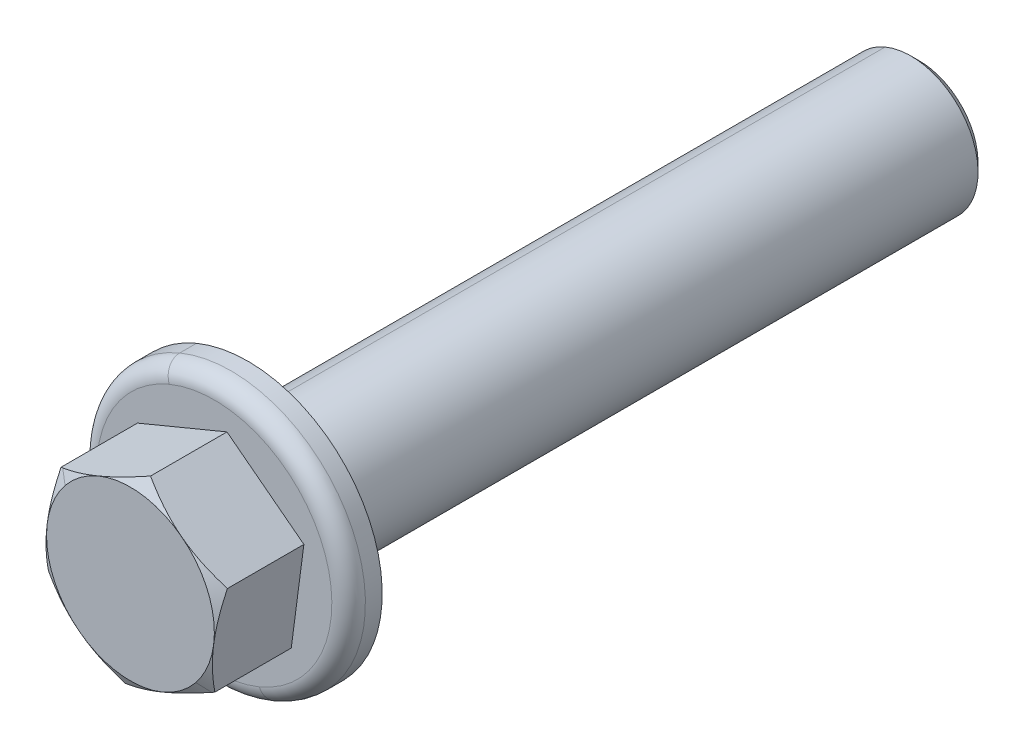
ISO-10303-21;
HEADER;
FILE_DESCRIPTION(('STEP AP214'),'2;1');
FILE_NAME('part.step','',(''),(''),'','','');
FILE_SCHEMA(('AUTOMOTIVE_DESIGN { 1 0 10303 214 1 1 1 1 }'));
ENDSEC;
DATA;
#1=APPLICATION_CONTEXT('core data for automotive mechanical design processes');
#2=APPLICATION_PROTOCOL_DEFINITION('international standard','automotive_design',2000,#1);
#3=PRODUCT_CONTEXT('',#1,'mechanical');
#4=PRODUCT('Part','Part','',(#3));
#5=PRODUCT_RELATED_PRODUCT_CATEGORY('part','',(#4));
#6=PRODUCT_DEFINITION_FORMATION('','',#4);
#7=PRODUCT_DEFINITION_CONTEXT('part definition',#1,'design');
#8=PRODUCT_DEFINITION('design','',#6,#7);
#9=PRODUCT_DEFINITION_SHAPE('','',#8);
#10=(LENGTH_UNIT() NAMED_UNIT(*) SI_UNIT(.MILLI.,.METRE.));
#11=(NAMED_UNIT(*) PLANE_ANGLE_UNIT() SI_UNIT($,.RADIAN.));
#12=(NAMED_UNIT(*) SI_UNIT($,.STERADIAN.) SOLID_ANGLE_UNIT());
#13=UNCERTAINTY_MEASURE_WITH_UNIT(LENGTH_MEASURE(1.E-05),#10,'distance_accuracy_value','');
#14=(GEOMETRIC_REPRESENTATION_CONTEXT(3) GLOBAL_UNCERTAINTY_ASSIGNED_CONTEXT((#13)) GLOBAL_UNIT_ASSIGNED_CONTEXT((#10,
#11,#12)) REPRESENTATION_CONTEXT('',''));
#15=CARTESIAN_POINT('',(0.,0.,0.));
#16=DIRECTION('',(0.,0.,1.));
#17=DIRECTION('',(1.,0.,0.));
#18=AXIS2_PLACEMENT_3D('',#15,#16,#17);
#19=CARTESIAN_POINT('',(125.,-43.,24.3));
#20=DIRECTION('',(0.,0.,1.));
#21=DIRECTION('',(0.923728021347068,0.383049008063238,0.));
#22=AXIS2_PLACEMENT_3D('',#19,#20,#21);
#23=TOROIDAL_SURFACE('',#22,4.25,0.25);
#24=CARTESIAN_POINT('',(125.,-43.,24.55));
#25=DIRECTION('',(0.,0.,-1.));
#26=DIRECTION('',(-0.923728021347068,-0.383049008063239,0.));
#27=AXIS2_PLACEMENT_3D('',#24,#25,#26);
#28=CIRCLE('',#27,4.25);
#29=CARTESIAN_POINT('',(126.627958284269,-46.925844090725,24.55));
#30=VERTEX_POINT('',#29);
#31=CARTESIAN_POINT('',(123.372041715731,-39.074155909275,24.55));
#32=VERTEX_POINT('',#31);
#33=EDGE_CURVE('E11',#30,#32,#28,.T.);
#34=ORIENTED_EDGE('',*,*,#33,.T.);
#35=CARTESIAN_POINT('',(123.372041715731,-39.074155909275,24.3));
#36=DIRECTION('',(0.923728021347068,0.383049008063238,0.));
#37=DIRECTION('',(0.,0.,1.));
#38=AXIS2_PLACEMENT_3D('',#35,#36,#37);
#39=CIRCLE('',#38,0.25);
#40=CARTESIAN_POINT('',(123.467803967747,-39.3050879146117,24.3));
#41=VERTEX_POINT('',#40);
#42=EDGE_CURVE('E33',#32,#41,#39,.T.);
#43=ORIENTED_EDGE('',*,*,#42,.T.);
#44=CARTESIAN_POINT('',(125.,-43.,24.3));
#45=DIRECTION('',(0.,0.,-1.));
#46=DIRECTION('',(-0.923728021347069,-0.383049008063237,0.));
#47=AXIS2_PLACEMENT_3D('',#44,#45,#46);
#48=CIRCLE('',#47,4.);
#49=CARTESIAN_POINT('',(126.532196032253,-46.6949120853883,24.3));
#50=VERTEX_POINT('',#49);
#51=EDGE_CURVE('E461',#50,#41,#48,.T.);
#52=ORIENTED_EDGE('',*,*,#51,.F.);
#53=CARTESIAN_POINT('',(126.627958284269,-46.925844090725,24.3));
#54=DIRECTION('',(-0.923728021347068,-0.383049008063238,0.));
#55=DIRECTION('',(0.,0.,1.));
#56=AXIS2_PLACEMENT_3D('',#53,#54,#55);
#57=CIRCLE('',#56,0.25);
#58=EDGE_CURVE('E457',#30,#50,#57,.T.);
#59=ORIENTED_EDGE('',*,*,#58,.F.);
#60=EDGE_LOOP('',(#34,#43,#52,#59));
#61=FACE_BOUND('',#60,.T.);
#62=ADVANCED_FACE('F17',(#61),#23,.F.);
#63=CARTESIAN_POINT('',(125.,-43.,24.3));
#64=DIRECTION('',(0.,0.,1.));
#65=DIRECTION('',(-0.383049008063241,0.923728021347067,0.));
#66=AXIS2_PLACEMENT_3D('',#63,#64,#65);
#67=TOROIDAL_SURFACE('',#66,4.25,0.25);
#68=CARTESIAN_POINT('',(125.,-43.,24.55));
#69=DIRECTION('',(0.,0.,-1.));
#70=DIRECTION('',(-0.923728021347068,-0.383049008063239,0.));
#71=AXIS2_PLACEMENT_3D('',#68,#69,#70);
#72=CIRCLE('',#71,4.25);
#73=EDGE_CURVE('E454',#32,#30,#72,.T.);
#74=ORIENTED_EDGE('',*,*,#73,.T.);
#75=ORIENTED_EDGE('',*,*,#58,.T.);
#76=CARTESIAN_POINT('',(125.,-43.,24.3));
#77=DIRECTION('',(0.,0.,-1.));
#78=DIRECTION('',(-0.923728021347069,-0.383049008063237,0.));
#79=AXIS2_PLACEMENT_3D('',#76,#77,#78);
#80=CIRCLE('',#79,4.);
#81=EDGE_CURVE('E465',#41,#50,#80,.T.);
#82=ORIENTED_EDGE('',*,*,#81,.F.);
#83=ORIENTED_EDGE('',*,*,#42,.F.);
#84=EDGE_LOOP('',(#74,#75,#82,#83));
#85=FACE_BOUND('',#84,.T.);
#86=ADVANCED_FACE('F311',(#85),#67,.F.);
#87=CARTESIAN_POINT('',(125.,-43.,4.55));
#88=DIRECTION('',(0.,0.,1.));
#89=DIRECTION('',(0.923728021347069,0.383049008063237,0.));
#90=AXIS2_PLACEMENT_3D('',#87,#88,#89);
#91=CYLINDRICAL_SURFACE('',#90,4.);
#92=DIRECTION('',(0.,0.,-1.));
#93=VECTOR('',#92,1.);
#94=CARTESIAN_POINT('',(126.532196032253,-46.6949120853883,4.55));
#95=LINE('',#94,#93);
#96=CARTESIAN_POINT('',(126.532196032253,-46.6949120853883,-14.95));
#97=VERTEX_POINT('',#96);
#98=EDGE_CURVE('E468',#50,#97,#95,.T.);
#99=ORIENTED_EDGE('',*,*,#98,.F.);
#100=ORIENTED_EDGE('',*,*,#51,.T.);
#101=DIRECTION('',(0.,0.,-1.));
#102=VECTOR('',#101,1.);
#103=CARTESIAN_POINT('',(123.467803967747,-39.3050879146117,4.55));
#104=LINE('',#103,#102);
#105=CARTESIAN_POINT('',(123.467803967747,-39.3050879146117,-14.95));
#106=VERTEX_POINT('',#105);
#107=EDGE_CURVE('E472',#41,#106,#104,.T.);
#108=ORIENTED_EDGE('',*,*,#107,.T.);
#109=CARTESIAN_POINT('',(125.,-43.,-14.95));
#110=DIRECTION('',(0.,0.,1.));
#111=DIRECTION('',(-0.923728021347069,-0.383049008063237,0.));
#112=AXIS2_PLACEMENT_3D('',#109,#110,#111);
#113=CIRCLE('',#112,4.);
#114=EDGE_CURVE('E467',#106,#97,#113,.T.);
#115=ORIENTED_EDGE('',*,*,#114,.T.);
#116=EDGE_LOOP('',(#99,#100,#108,#115));
#117=FACE_BOUND('',#116,.T.);
#118=ADVANCED_FACE('F317',(#117),#91,.T.);
#119=CARTESIAN_POINT('',(125.,-43.,4.55));
#120=DIRECTION('',(0.,0.,1.));
#121=DIRECTION('',(0.923728021347069,0.383049008063237,0.));
#122=AXIS2_PLACEMENT_3D('',#119,#120,#121);
#123=CYLINDRICAL_SURFACE('',#122,4.);
#124=ORIENTED_EDGE('',*,*,#107,.F.);
#125=ORIENTED_EDGE('',*,*,#81,.T.);
#126=ORIENTED_EDGE('',*,*,#98,.T.);
#127=CARTESIAN_POINT('',(125.,-43.,-14.95));
#128=DIRECTION('',(0.,0.,1.));
#129=DIRECTION('',(-0.923728021347069,-0.383049008063237,0.));
#130=AXIS2_PLACEMENT_3D('',#127,#128,#129);
#131=CIRCLE('',#130,4.);
#132=EDGE_CURVE('E471',#97,#106,#131,.T.);
#133=ORIENTED_EDGE('',*,*,#132,.T.);
#134=EDGE_LOOP('',(#124,#125,#126,#133));
#135=FACE_BOUND('',#134,.T.);
#136=ADVANCED_FACE('F322',(#135),#123,.T.);
#137=CARTESIAN_POINT('',(125.,-43.,-18.95));
#138=DIRECTION('',(0.,0.,1.));
#139=DIRECTION('',(-0.114958388351689,0.993370308066223,0.));
#140=AXIS2_PLACEMENT_3D('',#137,#138,#139);
#141=CONICAL_SURFACE('',#140,0.,0.785398163396999);
#142=DIRECTION('',(0.270856393052956,-0.653174413416782,-0.707106781186537));
#143=VECTOR('',#142,1.);
#144=CARTESIAN_POINT('',(123.563567058084,-39.5360195723158,-15.2));
#145=LINE('',#144,#143);
#146=CARTESIAN_POINT('',(123.659328713789,-39.7669518249291,-15.45));
#147=VERTEX_POINT('',#146);
#148=EDGE_CURVE('E478',#106,#147,#145,.T.);
#149=ORIENTED_EDGE('',*,*,#148,.T.);
#150=CARTESIAN_POINT('',(125.,-43.,-15.45));
#151=DIRECTION('',(0.,0.,1.));
#152=DIRECTION('',(0.993370308066188,0.114958388351986,0.));
#153=AXIS2_PLACEMENT_3D('',#150,#151,#152);
#154=CIRCLE('',#153,3.5);
#155=CARTESIAN_POINT('',(126.340671528221,-46.2330480747147,-15.45));
#156=VERTEX_POINT('',#155);
#157=EDGE_CURVE('E481',#147,#156,#154,.T.);
#158=ORIENTED_EDGE('',*,*,#157,.T.);
#159=DIRECTION('',(-0.270856551128283,0.65317434786655,-0.707106781186547));
#160=VECTOR('',#159,1.);
#161=CARTESIAN_POINT('',(126.436433780237,-46.4639800800515,-15.2));
#162=LINE('',#161,#160);
#163=EDGE_CURVE('E484',#97,#156,#162,.T.);
#164=ORIENTED_EDGE('',*,*,#163,.F.);
#165=ORIENTED_EDGE('',*,*,#114,.F.);
#166=EDGE_LOOP('',(#149,#158,#164,#165));
#167=FACE_BOUND('',#166,.T.);
#168=ADVANCED_FACE('F326',(#167),#141,.T.);
#169=CARTESIAN_POINT('',(125.,-42.9999999999988,-18.95));
#170=DIRECTION('',(-2.07112037355488E-13,-2.99341000002082E-13,1.));
#171=DIRECTION('',(0.383049008063238,-0.923728021347068,-1.97175609173E-13));
#172=AXIS2_PLACEMENT_3D('',#169,#170,#171);
#173=CONICAL_SURFACE('',#172,0.,0.785398163396999);
#174=ORIENTED_EDGE('',*,*,#163,.T.);
#175=CARTESIAN_POINT('',(125.,-43.,-15.4499999999993));
#176=DIRECTION('',(-2.8263995886347E-13,-1.17204364682804E-13,1.));
#177=DIRECTION('',(0.923728021347068,0.383049008063238,3.05977465587E-13));
#178=AXIS2_PLACEMENT_3D('',#175,#176,#177);
#179=CIRCLE('',#178,3.5);
#180=EDGE_CURVE('E352',#156,#147,#179,.T.);
#181=ORIENTED_EDGE('',*,*,#180,.T.);
#182=ORIENTED_EDGE('',*,*,#148,.F.);
#183=ORIENTED_EDGE('',*,*,#132,.F.);
#184=EDGE_LOOP('',(#174,#181,#182,#183));
#185=FACE_BOUND('',#184,.T.);
#186=ADVANCED_FACE('F330',(#185),#173,.T.);
#187=CARTESIAN_POINT('',(125.,-43.,-15.45));
#188=DIRECTION('',(0.,0.,1.));
#189=DIRECTION('',(-0.383049008063238,0.923728021347068,0.));
#190=AXIS2_PLACEMENT_3D('',#187,#188,#189);
#191=PLANE('',#190);
#192=ORIENTED_EDGE('',*,*,#180,.F.);
#193=ORIENTED_EDGE('',*,*,#157,.F.);
#194=EDGE_LOOP('',(#192,#193));
#195=FACE_BOUND('',#194,.T.);
#196=ADVANCED_FACE('F334',(#195),#191,.F.);
#197=CARTESIAN_POINT('',(125.,-43.,31.55));
#198=DIRECTION('',(0.,0.,1.));
#199=DIRECTION('',(0.923728021347068,0.383049008063238,0.));
#200=AXIS2_PLACEMENT_3D('',#197,#198,#199);
#201=PLANE('',#200);
#202=CARTESIAN_POINT('',(125.,-43.,31.55));
#203=DIRECTION('',(0.,0.,1.));
#204=DIRECTION('',(-0.923728021347068,-0.383049008063239,0.));
#205=AXIS2_PLACEMENT_3D('',#202,#203,#204);
#206=CIRCLE('',#205,5.);
#207=CARTESIAN_POINT('',(129.95748218353,-43.6506691939829,31.5499999999993));
#208=VERTEX_POINT('',#207);
#209=CARTESIAN_POINT('',(128.042237143212,-39.0320290872445,31.5499999999992));
#210=VERTEX_POINT('',#209);
#211=EDGE_CURVE('E347',#208,#210,#206,.T.);
#212=ORIENTED_EDGE('',*,*,#211,.T.);
#213=CARTESIAN_POINT('',(125.,-43.,31.55));
#214=DIRECTION('',(0.,0.,1.));
#215=DIRECTION('',(-0.923728021347068,-0.383049008063239,0.));
#216=AXIS2_PLACEMENT_3D('',#213,#214,#215);
#217=CIRCLE('',#216,5.);
#218=CARTESIAN_POINT('',(123.084754959684,-38.3813598932646,31.55));
#219=VERTEX_POINT('',#218);
#220=EDGE_CURVE('E353',#210,#219,#217,.T.);
#221=ORIENTED_EDGE('',*,*,#220,.T.);
#222=CARTESIAN_POINT('',(125.,-43.,31.55));
#223=DIRECTION('',(0.,0.,1.));
#224=DIRECTION('',(-0.923728021347068,-0.383049008063239,0.));
#225=AXIS2_PLACEMENT_3D('',#222,#223,#224);
#226=CIRCLE('',#225,5.);
#227=CARTESIAN_POINT('',(121.104920330083,-39.8649793676955,31.55));
#228=VERTEX_POINT('',#227);
#229=EDGE_CURVE('E368',#219,#228,#226,.T.);
#230=ORIENTED_EDGE('',*,*,#229,.T.);
#231=CARTESIAN_POINT('',(125.,-43.,31.55));
#232=DIRECTION('',(0.,0.,1.));
#233=DIRECTION('',(-0.923728021347068,-0.383049008063239,0.));
#234=AXIS2_PLACEMENT_3D('',#231,#232,#233);
#235=CIRCLE('',#234,5.);
#236=CARTESIAN_POINT('',(120.04251781647,-42.3493308060172,31.5499999999993));
#237=VERTEX_POINT('',#236);
#238=EDGE_CURVE('E372',#228,#237,#235,.T.);
#239=ORIENTED_EDGE('',*,*,#238,.T.);
#240=CARTESIAN_POINT('',(125.,-43.,31.55));
#241=DIRECTION('',(0.,0.,1.));
#242=DIRECTION('',(-0.923728021347068,-0.383049008063239,0.));
#243=AXIS2_PLACEMENT_3D('',#240,#241,#242);
#244=CIRCLE('',#243,5.);
#245=CARTESIAN_POINT('',(121.957762856788,-46.9679709127555,31.5499999999992));
#246=VERTEX_POINT('',#245);
#247=EDGE_CURVE('E172',#237,#246,#244,.T.);
#248=ORIENTED_EDGE('',*,*,#247,.T.);
#249=CARTESIAN_POINT('',(125.,-43.,31.55));
#250=DIRECTION('',(0.,0.,1.));
#251=DIRECTION('',(-0.923728021347068,-0.383049008063239,0.));
#252=AXIS2_PLACEMENT_3D('',#249,#250,#251);
#253=CIRCLE('',#252,5.);
#254=CARTESIAN_POINT('',(126.915245040316,-47.6186401067354,31.55));
#255=VERTEX_POINT('',#254);
#256=EDGE_CURVE('E147',#246,#255,#253,.T.);
#257=ORIENTED_EDGE('',*,*,#256,.T.);
#258=CARTESIAN_POINT('',(125.,-43.,31.55));
#259=DIRECTION('',(0.,0.,1.));
#260=DIRECTION('',(-0.923728021347068,-0.383049008063239,0.));
#261=AXIS2_PLACEMENT_3D('',#258,#259,#260);
#262=CIRCLE('',#261,5.);
#263=CARTESIAN_POINT('',(128.895079669917,-46.1350206323045,31.55));
#264=VERTEX_POINT('',#263);
#265=EDGE_CURVE('E160',#255,#264,#262,.T.);
#266=ORIENTED_EDGE('',*,*,#265,.T.);
#267=CARTESIAN_POINT('',(125.,-43.,31.55));
#268=DIRECTION('',(0.,0.,1.));
#269=DIRECTION('',(-0.923728021347068,-0.383049008063239,0.));
#270=AXIS2_PLACEMENT_3D('',#267,#268,#269);
#271=CIRCLE('',#270,5.);
#272=EDGE_CURVE('E166',#264,#208,#271,.T.);
#273=ORIENTED_EDGE('',*,*,#272,.T.);
#274=EDGE_LOOP('',(#212,#221,#230,#239,#248,#257,#266,#273));
#275=FACE_BOUND('',#274,.T.);
#276=ADVANCED_FACE('F169',(#275),#201,.T.);
#277=CARTESIAN_POINT('',(125.,-43.,31.55));
#278=DIRECTION('',(0.,0.,-1.));
#279=DIRECTION('',(0.779015933983816,-0.62700412646116,0.));
#280=AXIS2_PLACEMENT_3D('',#277,#278,#279);
#281=CONICAL_SURFACE('',#280,5.,1.0471975512);
#282=ORIENTED_EDGE('',*,*,#211,.F.);
#283=CARTESIAN_POINT('',(130.333146217831,-40.788465520816,31.1034180126157));
#284=CARTESIAN_POINT('',(130.3025673255,-41.0214476802984,31.1712680083951));
#285=CARTESIAN_POINT('',(130.271743546411,-41.2562956446373,31.2334304503107));
#286=CARTESIAN_POINT('',(130.209824279666,-41.7280617349024,31.3430527974047));
#287=CARTESIAN_POINT('',(130.178730951812,-41.9649634052019,31.3905854034297));
#288=CARTESIAN_POINT('',(130.131797514476,-42.322551687472,31.4489473736346));
#289=CARTESIAN_POINT('',(130.11609374839,-42.442199492084,31.4662522919641));
#290=CARTESIAN_POINT('',(130.084611035887,-42.6820679041194,31.4962074663214));
#291=CARTESIAN_POINT('',(130.068832091461,-42.8022884963822,31.5088578448603));
#292=CARTESIAN_POINT('',(130.037140657916,-43.0437471648116,31.5292816727013));
#293=CARTESIAN_POINT('',(130.021227896041,-43.1649873191297,31.5370303207408));
#294=CARTESIAN_POINT('',(129.989371077041,-43.4077060678825,31.5474002095296));
#295=CARTESIAN_POINT('',(129.973427014344,-43.5291847047729,31.5500204348121));
#296=CARTESIAN_POINT('',(129.957482183531,-43.650669193983,31.5499999999984));
#297=B_SPLINE_CURVE_WITH_KNOTS('',3,(#283,#284,#285,#286,#287,#288,#289,#290,#291,#292,#293,
#294,#295,#296),.UNSPECIFIED.,.F.,.F.,(4,2,2,2,2,2,4),(0.,0.734036658391584,1.46436443241697,
1.83000749078367,2.19564092445857,2.56310985866722,2.93065154716803),.UNSPECIFIED.);
#298=CARTESIAN_POINT('',(130.333146217831,-40.788465520817,31.1034180126157));
#299=VERTEX_POINT('',#298);
#300=EDGE_CURVE('E218',#299,#208,#297,.T.);
#301=ORIENTED_EDGE('',*,*,#300,.F.);
#302=CARTESIAN_POINT('',(128.042237143213,-39.0320290872434,31.5499999999984));
#303=CARTESIAN_POINT('',(128.139473381628,-39.1065799603917,31.5500204348121));
#304=CARTESIAN_POINT('',(128.236704935844,-39.1811272421717,31.5474002095296));
#305=CARTESIAN_POINT('',(128.430977128739,-39.3300754310856,31.5370303207408));
#306=CARTESIAN_POINT('',(128.5280178014,-39.4044763642732,31.5292816727013));
#307=CARTESIAN_POINT('',(128.721281425451,-39.5526512850197,31.5088578448603));
#308=CARTESIAN_POINT('',(128.817506040196,-39.626426547869,31.4962074663214));
#309=CARTESIAN_POINT('',(129.009496822333,-39.773625582694,31.4662522919641));
#310=CARTESIAN_POINT('',(129.10526297759,-39.8470493453661,31.4489473736346));
#311=CARTESIAN_POINT('',(129.391476795464,-40.0664890355205,31.3905854034297));
#312=CARTESIAN_POINT('',(129.581092996215,-40.2118674824807,31.3430527974047));
#313=CARTESIAN_POINT('',(129.958694781657,-40.5013741855972,31.2334304503107));
#314=CARTESIAN_POINT('',(130.146667195257,-40.6454923434987,31.1712680083951));
#315=CARTESIAN_POINT('',(130.333146217832,-40.7884655208181,31.1034180126157));
#316=B_SPLINE_CURVE_WITH_KNOTS('',3,(#302,#303,#304,#305,#306,#307,#308,#309,#310,#311,#312,
#313,#314,#315),.UNSPECIFIED.,.F.,.F.,(4,2,2,2,2,2,4),(0.,0.367541688500858,0.735010622709565,
1.10064405638451,1.46628711475129,2.19661488877679,2.93065154716846),.UNSPECIFIED.);
#317=EDGE_CURVE('E234',#210,#299,#316,.T.);
#318=ORIENTED_EDGE('',*,*,#317,.F.);
#319=EDGE_LOOP('',(#282,#301,#318));
#320=FACE_BOUND('',#319,.T.);
#321=ADVANCED_FACE('F248',(#320),#281,.T.);
#322=CARTESIAN_POINT('',(125.,-43.,31.55));
#323=DIRECTION('',(0.,0.,-1.));
#324=DIRECTION('',(0.779015933983816,-0.62700412646116,0.));
#325=AXIS2_PLACEMENT_3D('',#322,#323,#324);
#326=CONICAL_SURFACE('',#325,5.,1.0471975512);
#327=ORIENTED_EDGE('',*,*,#220,.F.);
#328=CARTESIAN_POINT('',(125.751328068599,-37.2755926536722,31.1034180126172));
#329=CARTESIAN_POINT('',(125.937807091173,-37.4185658309914,31.1712680083964));
#330=CARTESIAN_POINT('',(126.125779504773,-37.5626839888926,31.2334304503118));
#331=CARTESIAN_POINT('',(126.503381290214,-37.8521906920085,31.3430527974054));
#332=CARTESIAN_POINT('',(126.692997490964,-37.9975691389684,31.3905854034303));
#333=CARTESIAN_POINT('',(126.979211308838,-38.2170088291224,31.448947373635));
#334=CARTESIAN_POINT('',(127.074977464095,-38.2904325917943,31.4662522919644));
#335=CARTESIAN_POINT('',(127.266968246232,-38.437631626619,31.4962074663216));
#336=CARTESIAN_POINT('',(127.363192860976,-38.5114068894682,31.5088578448604));
#337=CARTESIAN_POINT('',(127.556456485027,-38.6595818102144,31.5292816727014));
#338=CARTESIAN_POINT('',(127.653497157688,-38.7339827434018,31.5370303207409));
#339=CARTESIAN_POINT('',(127.847769350582,-38.8829309323154,31.5474002095296));
#340=CARTESIAN_POINT('',(127.945000904798,-38.9574782140952,31.5500204348121));
#341=CARTESIAN_POINT('',(128.042237143213,-39.0320290872434,31.5499999999984));
#342=B_SPLINE_CURVE_WITH_KNOTS('',3,(#328,#329,#330,#331,#332,#333,#334,#335,#336,#337,#338,
#339,#340,#341),.UNSPECIFIED.,.F.,.F.,(4,2,2,2,2,2,4),(0.,0.734036658390181,1.46436443241422,
1.83000749078024,2.19564092445444,2.56310985866231,2.93065154716246),.UNSPECIFIED.);
#343=CARTESIAN_POINT('',(125.7513280686,-37.2755926536723,31.1034180126172));
#344=VERTEX_POINT('',#343);
#345=EDGE_CURVE('E225',#344,#210,#342,.T.);
#346=ORIENTED_EDGE('',*,*,#345,.F.);
#347=CARTESIAN_POINT('',(123.084754959684,-38.3813598932646,31.55));
#348=CARTESIAN_POINT('',(123.197936028912,-38.3344262772027,31.5500204348137));
#349=CARTESIAN_POINT('',(123.311111645825,-38.2874949220923,31.5474002095312));
#350=CARTESIAN_POINT('',(123.537240657719,-38.1937243622535,31.5370303207423));
#351=CARTESIAN_POINT('',(123.650194092255,-38.146885141123,31.5292816727028));
#352=CARTESIAN_POINT('',(123.875149149851,-38.0536013934401,31.5088578448618));
#353=CARTESIAN_POINT('',(123.987152709022,-38.0071560640266,31.4962074663229));
#354=CARTESIAN_POINT('',(124.210626203661,-37.9144866868162,31.4662522919656));
#355=CARTESIAN_POINT('',(124.322096125006,-37.8682626448763,31.4489473736361));
#356=CARTESIAN_POINT('',(124.655243380215,-37.7301140527607,31.3905854034312));
#357=CARTESIAN_POINT('',(124.87595290882,-37.6385908294214,31.3430527974062));
#358=CARTESIAN_POINT('',(125.315473961006,-37.4563314422729,31.2334304503122));
#359=CARTESIAN_POINT('',(125.534270153695,-37.3656016358355,31.1712680083966));
#360=CARTESIAN_POINT('',(125.751328068601,-37.2755926536725,31.1034180126172));
#361=B_SPLINE_CURVE_WITH_KNOTS('',3,(#347,#348,#349,#350,#351,#352,#353,#354,#355,#356,#357,
#358,#359,#360),.UNSPECIFIED.,.F.,.F.,(4,2,2,2,2,2,4),(0.,0.367541688500744,0.735010622709319,
1.10064405638414,1.46628711475078,2.19661488877598,2.93065154716748),.UNSPECIFIED.);
#362=EDGE_CURVE('E256',#219,#344,#361,.T.);
#363=ORIENTED_EDGE('',*,*,#362,.F.);
#364=EDGE_LOOP('',(#327,#346,#363));
#365=FACE_BOUND('',#364,.T.);
#366=ADVANCED_FACE('F243',(#365),#326,.T.);
#367=CARTESIAN_POINT('',(125.,-43.,31.55));
#368=DIRECTION('',(0.,0.,-1.));
#369=DIRECTION('',(0.779015933983816,-0.62700412646116,0.));
#370=AXIS2_PLACEMENT_3D('',#367,#368,#369);
#371=CONICAL_SURFACE('',#370,5.,1.0471975512);
#372=DIRECTION('',(0.674647588782705,-0.543001501793055,0.500000000000169));
#373=VECTOR('',#372,1.);
#374=CARTESIAN_POINT('',(119.366922415415,-38.4661224037524,30.2619216436));
#375=LINE('',#374,#373);
#376=CARTESIAN_POINT('',(120.561580369679,-39.4276630274513,31.147315717563));
#377=VERTEX_POINT('',#376);
#378=EDGE_CURVE('E359',#377,#228,#375,.T.);
#379=ORIENTED_EDGE('',*,*,#378,.T.);
#380=ORIENTED_EDGE('',*,*,#229,.F.);
#381=CARTESIAN_POINT('',(120.561580369675,-39.4276630274456,31.1473157175507));
#382=CARTESIAN_POINT('',(120.767321714802,-39.342346769475,31.2089939702821));
#383=CARTESIAN_POINT('',(120.974622429953,-39.2563838762071,31.2652901400361));
#384=CARTESIAN_POINT('',(121.390932907383,-39.0837493866827,31.3643275190329));
#385=CARTESIAN_POINT('',(121.599930196708,-38.9970829626767,31.4071306974177));
#386=CARTESIAN_POINT('',(121.915212095264,-38.8663427277683,31.45956230126));
#387=CARTESIAN_POINT('',(122.02066262896,-38.8226147890261,31.475082637656));
#388=CARTESIAN_POINT('',(122.232020427228,-38.7349695156316,31.5019229351795));
#389=CARTESIAN_POINT('',(122.337927683107,-38.6910521845844,31.5132429759078));
#390=CARTESIAN_POINT('',(122.550560143613,-38.6028783377413,31.5315033490443));
#391=CARTESIAN_POINT('',(122.657286864002,-38.5586211933935,31.5384231328081));
#392=CARTESIAN_POINT('',(122.870925975233,-38.4700299113827,31.5476799879821));
#393=CARTESIAN_POINT('',(122.977838392784,-38.425695762644,31.5500163340106));
#394=CARTESIAN_POINT('',(123.084754959684,-38.3813598932646,31.55));
#395=B_SPLINE_CURVE_WITH_KNOTS('',3,(#381,#382,#383,#384,#385,#386,#387,#388,#389,#390,#391,
#392,#393,#394),.UNSPECIFIED.,.F.,.F.,(4,2,2,2,2,2,4),(0.,0.693572709725148,1.38391201165264,
1.72946469135599,2.07501082206967,2.42215898329328,2.76936208027106),.UNSPECIFIED.);
#396=EDGE_CURVE('E262',#377,#219,#395,.T.);
#397=ORIENTED_EDGE('',*,*,#396,.F.);
#398=EDGE_LOOP('',(#379,#380,#397));
#399=FACE_BOUND('',#398,.T.);
#400=ADVANCED_FACE('F247',(#399),#371,.T.);
#401=CARTESIAN_POINT('',(125.,-43.,31.55));
#402=DIRECTION('',(0.,0.,-1.));
#403=DIRECTION('',(0.779015933983816,-0.62700412646116,0.));
#404=AXIS2_PLACEMENT_3D('',#401,#402,#403);
#405=CONICAL_SURFACE('',#404,5.,1.0471975512);
#406=ORIENTED_EDGE('',*,*,#238,.F.);
#407=ORIENTED_EDGE('',*,*,#378,.F.);
#408=CARTESIAN_POINT('',(120.561580369681,-39.4276630274507,31.1473157175));
#409=CARTESIAN_POINT('',(120.514400627322,-39.4472273939026,31.1331782382));
#410=CARTESIAN_POINT('',(120.466617991441,-39.4670417665899,31.1185548376));
#411=CARTESIAN_POINT('',(120.418181850768,-39.487127132856,31.1034180126));
#412=B_SPLINE_CURVE_WITH_KNOTS('',3,(#408,#409,#410,#411),.UNSPECIFIED.,.F.,.F.,(4,4),(0.,1.),.UNSPECIFIED.);
#413=CARTESIAN_POINT('',(120.418181850768,-39.4871271328537,31.1034180126081));
#414=VERTEX_POINT('',#413);
#415=EDGE_CURVE('E362',#377,#414,#412,.T.);
#416=ORIENTED_EDGE('',*,*,#415,.T.);
#417=CARTESIAN_POINT('',(120.042517816469,-42.349330806017,31.5499999999984));
#418=CARTESIAN_POINT('',(120.058462647282,-42.2278463168069,31.5500204348121));
#419=CARTESIAN_POINT('',(120.074406709979,-42.1063676799165,31.5474002095296));
#420=CARTESIAN_POINT('',(120.106263528978,-41.8636489311638,31.5370303207409));
#421=CARTESIAN_POINT('',(120.122176290854,-41.7424087768458,31.5292816727013));
#422=CARTESIAN_POINT('',(120.153867724398,-41.5009501084165,31.5088578448604));
#423=CARTESIAN_POINT('',(120.169646668825,-41.3807295161538,31.4962074663215));
#424=CARTESIAN_POINT('',(120.201129381327,-41.1408611041186,31.4662522919642));
#425=CARTESIAN_POINT('',(120.216833147414,-41.0212132995066,31.4489473736348));
#426=CARTESIAN_POINT('',(120.263766584749,-40.6636250172367,31.3905854034299));
#427=CARTESIAN_POINT('',(120.294859912604,-40.4267233469373,31.343052797405));
#428=CARTESIAN_POINT('',(120.356779179348,-39.9549572566725,31.2334304503111));
#429=CARTESIAN_POINT('',(120.387602958438,-39.7201092923337,31.1712680083955));
#430=CARTESIAN_POINT('',(120.418181850769,-39.4871271328513,31.1034180126162));
#431=B_SPLINE_CURVE_WITH_KNOTS('',3,(#417,#418,#419,#420,#421,#422,#423,#424,#425,#426,#427,
#428,#429,#430),.UNSPECIFIED.,.F.,.F.,(4,2,2,2,2,2,4),(0.,0.367541688500619,0.73501062270906,
1.10064405638376,1.46628711475026,2.19661488877526,2.93065154716644),.UNSPECIFIED.);
#432=EDGE_CURVE('E287',#237,#414,#431,.T.);
#433=ORIENTED_EDGE('',*,*,#432,.F.);
#434=EDGE_LOOP('',(#406,#407,#416,#433));
#435=FACE_BOUND('',#434,.T.);
#436=ADVANCED_FACE('F297',(#435),#405,.T.);
#437=CARTESIAN_POINT('',(125.,-43.,31.55));
#438=DIRECTION('',(0.,0.,-1.));
#439=DIRECTION('',(0.779015933983816,-0.62700412646116,0.));
#440=AXIS2_PLACEMENT_3D('',#437,#438,#439);
#441=CONICAL_SURFACE('',#440,5.,1.0471975512);
#442=ORIENTED_EDGE('',*,*,#247,.F.);
#443=CARTESIAN_POINT('',(119.666853782169,-45.2115344791841,31.1034180126157));
#444=CARTESIAN_POINT('',(119.6974326745,-44.9785523197016,31.1712680083951));
#445=CARTESIAN_POINT('',(119.728256453589,-44.7437043553627,31.2334304503107));
#446=CARTESIAN_POINT('',(119.790175720334,-44.2719382650976,31.3430527974047));
#447=CARTESIAN_POINT('',(119.821269048188,-44.0350365947981,31.3905854034297));
#448=CARTESIAN_POINT('',(119.868202485524,-43.677448312528,31.4489473736346));
#449=CARTESIAN_POINT('',(119.88390625161,-43.557800507916,31.4662522919641));
#450=CARTESIAN_POINT('',(119.915388964113,-43.3179320958806,31.4962074663214));
#451=CARTESIAN_POINT('',(119.931167908539,-43.1977115036178,31.5088578448603));
#452=CARTESIAN_POINT('',(119.962859342084,-42.9562528351884,31.5292816727013));
#453=CARTESIAN_POINT('',(119.978772103959,-42.8350126808703,31.5370303207408));
#454=CARTESIAN_POINT('',(120.010628922959,-42.5922939321175,31.5474002095296));
#455=CARTESIAN_POINT('',(120.026572985656,-42.4708152952271,31.5500204348121));
#456=CARTESIAN_POINT('',(120.042517816469,-42.349330806017,31.5499999999984));
#457=B_SPLINE_CURVE_WITH_KNOTS('',3,(#443,#444,#445,#446,#447,#448,#449,#450,#451,#452,#453,
#454,#455,#456),.UNSPECIFIED.,.F.,.F.,(4,2,2,2,2,2,4),(0.,0.734036658391593,1.464364432417,
1.83000749078371,2.19564092445861,2.56310985866726,2.93065154716809),.UNSPECIFIED.);
#458=CARTESIAN_POINT('',(119.666853782168,-45.211534479183,31.1034180126157));
#459=VERTEX_POINT('',#458);
#460=EDGE_CURVE('E268',#459,#237,#457,.T.);
#461=ORIENTED_EDGE('',*,*,#460,.F.);
#462=CARTESIAN_POINT('',(121.957762856787,-46.9679709127566,31.5499999999984));
#463=CARTESIAN_POINT('',(121.860526618372,-46.8934200396083,31.5500204348121));
#464=CARTESIAN_POINT('',(121.763295064156,-46.8188727578283,31.5474002095296));
#465=CARTESIAN_POINT('',(121.569022871261,-46.6699245689144,31.5370303207408));
#466=CARTESIAN_POINT('',(121.4719821986,-46.5955236357268,31.5292816727013));
#467=CARTESIAN_POINT('',(121.278718574549,-46.4473487149803,31.5088578448603));
#468=CARTESIAN_POINT('',(121.182493959804,-46.373573452131,31.4962074663214));
#469=CARTESIAN_POINT('',(120.990503177667,-46.226374417306,31.4662522919641));
#470=CARTESIAN_POINT('',(120.89473702241,-46.1529506546339,31.4489473736346));
#471=CARTESIAN_POINT('',(120.608523204536,-45.9335109644795,31.3905854034297));
#472=CARTESIAN_POINT('',(120.418907003785,-45.7881325175194,31.3430527974047));
#473=CARTESIAN_POINT('',(120.041305218343,-45.4986258144028,31.2334304503107));
#474=CARTESIAN_POINT('',(119.853332804743,-45.3545076565014,31.1712680083951));
#475=CARTESIAN_POINT('',(119.666853782168,-45.211534479182,31.1034180126157));
#476=B_SPLINE_CURVE_WITH_KNOTS('',3,(#462,#463,#464,#465,#466,#467,#468,#469,#470,#471,#472,
#473,#474,#475),.UNSPECIFIED.,.F.,.F.,(4,2,2,2,2,2,4),(0.,0.367541688500851,0.735010622709547,
1.10064405638448,1.46628711475124,2.19661488877673,2.93065154716842),.UNSPECIFIED.);
#477=EDGE_CURVE('E188',#246,#459,#476,.T.);
#478=ORIENTED_EDGE('',*,*,#477,.F.);
#479=EDGE_LOOP('',(#442,#461,#478));
#480=FACE_BOUND('',#479,.T.);
#481=ADVANCED_FACE('F300',(#480),#441,.T.);
#482=CARTESIAN_POINT('',(125.,-43.,31.55));
#483=DIRECTION('',(0.,0.,-1.));
#484=DIRECTION('',(0.779015933983816,-0.62700412646116,0.));
#485=AXIS2_PLACEMENT_3D('',#482,#483,#484);
#486=CONICAL_SURFACE('',#485,5.,1.0471975512);
#487=ORIENTED_EDGE('',*,*,#256,.F.);
#488=CARTESIAN_POINT('',(124.248671931401,-48.7244073463278,31.1034180126172));
#489=CARTESIAN_POINT('',(124.062192908827,-48.5814341690087,31.1712680083964));
#490=CARTESIAN_POINT('',(123.874220495227,-48.4373160111075,31.2334304503118));
#491=CARTESIAN_POINT('',(123.496618709786,-48.1478093079915,31.3430527974054));
#492=CARTESIAN_POINT('',(123.307002509036,-48.0024308610316,31.3905854034303));
#493=CARTESIAN_POINT('',(123.020788691162,-47.7829911708776,31.448947373635));
#494=CARTESIAN_POINT('',(122.925022535905,-47.7095674082057,31.4662522919644));
#495=CARTESIAN_POINT('',(122.733031753768,-47.562368373381,31.4962074663216));
#496=CARTESIAN_POINT('',(122.636807139024,-47.4885931105318,31.5088578448604));
#497=CARTESIAN_POINT('',(122.443543514973,-47.3404181897857,31.5292816727013));
#498=CARTESIAN_POINT('',(122.346502842312,-47.2660172565982,31.5370303207408));
#499=CARTESIAN_POINT('',(122.152230649418,-47.1170690676846,31.5474002095296));
#500=CARTESIAN_POINT('',(122.054999095202,-47.0425217859048,31.5500204348121));
#501=CARTESIAN_POINT('',(121.957762856787,-46.9679709127566,31.5499999999984));
#502=B_SPLINE_CURVE_WITH_KNOTS('',3,(#488,#489,#490,#491,#492,#493,#494,#495,#496,#497,#498,
#499,#500,#501),.UNSPECIFIED.,.F.,.F.,(4,2,2,2,2,2,4),(0.,0.734036658390168,1.46436443241419,
1.83000749078021,2.19564092445441,2.56310985866236,2.93065154716247),.UNSPECIFIED.);
#503=CARTESIAN_POINT('',(124.2486719314,-48.7244073463276,31.1034180126172));
#504=VERTEX_POINT('',#503);
#505=EDGE_CURVE('E150',#504,#246,#502,.T.);
#506=ORIENTED_EDGE('',*,*,#505,.F.);
#507=CARTESIAN_POINT('',(126.915245040316,-47.6186401067355,31.55));
#508=CARTESIAN_POINT('',(126.802063971088,-47.6655737227973,31.5500204348137));
#509=CARTESIAN_POINT('',(126.688888354175,-47.7125050779077,31.5474002095312));
#510=CARTESIAN_POINT('',(126.462759342281,-47.8062756377465,31.5370303207423));
#511=CARTESIAN_POINT('',(126.349805907745,-47.853114858877,31.5292816727028));
#512=CARTESIAN_POINT('',(126.124850850149,-47.9463986065599,31.5088578448618));
#513=CARTESIAN_POINT('',(126.012847290978,-47.9928439359733,31.4962074663229));
#514=CARTESIAN_POINT('',(125.789373796339,-48.0855133131837,31.4662522919656));
#515=CARTESIAN_POINT('',(125.677903874994,-48.1317373551237,31.4489473736361));
#516=CARTESIAN_POINT('',(125.344756619785,-48.2698859472393,31.3905854034312));
#517=CARTESIAN_POINT('',(125.12404709118,-48.3614091705786,31.3430527974062));
#518=CARTESIAN_POINT('',(124.684526038994,-48.5436685577271,31.2334304503122));
#519=CARTESIAN_POINT('',(124.465729846305,-48.6343983641645,31.1712680083966));
#520=CARTESIAN_POINT('',(124.248671931399,-48.7244073463275,31.1034180126172));
#521=B_SPLINE_CURVE_WITH_KNOTS('',3,(#507,#508,#509,#510,#511,#512,#513,#514,#515,#516,#517,
#518,#519,#520),.UNSPECIFIED.,.F.,.F.,(4,2,2,2,2,2,4),(0.,0.367541688500741,0.735010622709313,
1.10064405638414,1.46628711475075,2.19661488877601,2.93065154716745),.UNSPECIFIED.);
#522=EDGE_CURVE('E21',#255,#504,#521,.T.);
#523=ORIENTED_EDGE('',*,*,#522,.F.);
#524=EDGE_LOOP('',(#487,#506,#523));
#525=FACE_BOUND('',#524,.T.);
#526=ADVANCED_FACE('F145',(#525),#486,.T.);
#527=CARTESIAN_POINT('',(125.,-43.,31.55));
#528=DIRECTION('',(0.,0.,-1.));
#529=DIRECTION('',(0.779015933983816,-0.62700412646116,0.));
#530=AXIS2_PLACEMENT_3D('',#527,#528,#529);
#531=CONICAL_SURFACE('',#530,5.,1.0471975512);
#532=DIRECTION('',(-0.674647588782705,0.543001501793055,0.500000000000169));
#533=VECTOR('',#532,1.);
#534=CARTESIAN_POINT('',(130.633077584584,-47.5338775962476,30.2619216436));
#535=LINE('',#534,#533);
#536=CARTESIAN_POINT('',(129.43841963032,-46.5723369725488,31.1473157175629));
#537=VERTEX_POINT('',#536);
#538=EDGE_CURVE('E163',#537,#264,#535,.T.);
#539=ORIENTED_EDGE('',*,*,#538,.T.);
#540=ORIENTED_EDGE('',*,*,#265,.F.);
#541=CARTESIAN_POINT('',(129.438419630325,-46.5723369725545,31.1473157175507));
#542=CARTESIAN_POINT('',(129.232678285198,-46.657653230525,31.2089939702821));
#543=CARTESIAN_POINT('',(129.025377570047,-46.743616123793,31.2652901400361));
#544=CARTESIAN_POINT('',(128.609067092617,-46.9162506133173,31.3643275190329));
#545=CARTESIAN_POINT('',(128.400069803292,-47.0029170373233,31.4071306974177));
#546=CARTESIAN_POINT('',(128.084787904736,-47.1336572722317,31.4595623012601));
#547=CARTESIAN_POINT('',(127.97933737104,-47.1773852109739,31.475082637656));
#548=CARTESIAN_POINT('',(127.767979572772,-47.2650304843684,31.5019229351795));
#549=CARTESIAN_POINT('',(127.662072316893,-47.3089478154156,31.5132429759078));
#550=CARTESIAN_POINT('',(127.449439856387,-47.3971216622586,31.5315033490443));
#551=CARTESIAN_POINT('',(127.342713135998,-47.4413788066065,31.5384231328081));
#552=CARTESIAN_POINT('',(127.129074024767,-47.5299700886173,31.5476799879821));
#553=CARTESIAN_POINT('',(127.022161607216,-47.5743042373561,31.5500163340106));
#554=CARTESIAN_POINT('',(126.915245040316,-47.6186401067355,31.55));
#555=B_SPLINE_CURVE_WITH_KNOTS('',3,(#541,#542,#543,#544,#545,#546,#547,#548,#549,#550,#551,
#552,#553,#554),.UNSPECIFIED.,.F.,.F.,(4,2,2,2,2,2,4),(0.,0.693572709725159,1.38391201165263,
1.72946469135596,2.07501082206964,2.42215898329326,2.76936208027105),.UNSPECIFIED.);
#556=EDGE_CURVE('E155',#537,#255,#555,.T.);
#557=ORIENTED_EDGE('',*,*,#556,.F.);
#558=EDGE_LOOP('',(#539,#540,#557));
#559=FACE_BOUND('',#558,.T.);
#560=ADVANCED_FACE('F161',(#559),#531,.T.);
#561=CARTESIAN_POINT('',(125.,-43.,31.55));
#562=DIRECTION('',(0.,0.,-1.));
#563=DIRECTION('',(0.779015933983816,-0.62700412646116,0.));
#564=AXIS2_PLACEMENT_3D('',#561,#562,#563);
#565=CONICAL_SURFACE('',#564,5.,1.0471975512);
#566=ORIENTED_EDGE('',*,*,#272,.F.);
#567=ORIENTED_EDGE('',*,*,#538,.F.);
#568=CARTESIAN_POINT('',(129.438419630319,-46.5723369725492,31.1473157175));
#569=CARTESIAN_POINT('',(129.485599372678,-46.5527726060974,31.1331782382));
#570=CARTESIAN_POINT('',(129.533382008559,-46.5329582334101,31.1185548376));
#571=CARTESIAN_POINT('',(129.581818149232,-46.512872867144,31.1034180126));
#572=B_SPLINE_CURVE_WITH_KNOTS('',3,(#568,#569,#570,#571),.UNSPECIFIED.,.F.,.F.,(4,4),(0.,1.),.UNSPECIFIED.);
#573=CARTESIAN_POINT('',(129.581818149232,-46.5128728671463,31.1034180126081));
#574=VERTEX_POINT('',#573);
#575=EDGE_CURVE('E178',#537,#574,#572,.T.);
#576=ORIENTED_EDGE('',*,*,#575,.T.);
#577=CARTESIAN_POINT('',(129.957482183531,-43.650669193983,31.5499999999984));
#578=CARTESIAN_POINT('',(129.941537352718,-43.7721536831931,31.5500204348121));
#579=CARTESIAN_POINT('',(129.925593290021,-43.8936323200835,31.5474002095296));
#580=CARTESIAN_POINT('',(129.893736471021,-44.1363510688362,31.5370303207409));
#581=CARTESIAN_POINT('',(129.877823709146,-44.2575912231542,31.5292816727013));
#582=CARTESIAN_POINT('',(129.846132275602,-44.4990498915835,31.5088578448604));
#583=CARTESIAN_POINT('',(129.830353331175,-44.6192704838462,31.4962074663215));
#584=CARTESIAN_POINT('',(129.798870618673,-44.8591388958814,31.4662522919642));
#585=CARTESIAN_POINT('',(129.783166852586,-44.9787867004934,31.4489473736348));
#586=CARTESIAN_POINT('',(129.736233415251,-45.3363749827633,31.3905854034299));
#587=CARTESIAN_POINT('',(129.705140087396,-45.5732766530627,31.343052797405));
#588=CARTESIAN_POINT('',(129.643220820652,-46.0450427433275,31.2334304503111));
#589=CARTESIAN_POINT('',(129.612397041562,-46.2798907076663,31.1712680083955));
#590=CARTESIAN_POINT('',(129.581818149231,-46.5128728671487,31.1034180126162));
#591=B_SPLINE_CURVE_WITH_KNOTS('',3,(#577,#578,#579,#580,#581,#582,#583,#584,#585,#586,#587,
#588,#589,#590),.UNSPECIFIED.,.F.,.F.,(4,2,2,2,2,2,4),(0.,0.367541688500631,0.735010622709072,
1.10064405638377,1.46628711475028,2.19661488877529,2.93065154716648),.UNSPECIFIED.);
#592=EDGE_CURVE('E211',#208,#574,#591,.T.);
#593=ORIENTED_EDGE('',*,*,#592,.F.);
#594=EDGE_LOOP('',(#566,#567,#576,#593));
#595=FACE_BOUND('',#594,.T.);
#596=ADVANCED_FACE('F201',(#595),#565,.T.);
#597=CARTESIAN_POINT('',(129.581818149232,-46.512872867144,24.55));
#598=DIRECTION('',(0.991496436705686,-0.130133838796557,0.));
#599=DIRECTION('',(-0.130133838796557,-0.991496436705686,0.));
#600=AXIS2_PLACEMENT_3D('',#597,#598,#599);
#601=PLANE('',#600);
#602=DIRECTION('',(0.,0.,1.));
#603=VECTOR('',#602,1.);
#604=CARTESIAN_POINT('',(130.333146217831,-40.7884655208173,28.8267090063));
#605=LINE('',#604,#603);
#606=CARTESIAN_POINT('',(130.333146217831,-40.7884655208173,26.55));
#607=VERTEX_POINT('',#606);
#608=EDGE_CURVE('E358',#607,#299,#605,.T.);
#609=ORIENTED_EDGE('',*,*,#608,.T.);
#610=ORIENTED_EDGE('',*,*,#300,.T.);
#611=ORIENTED_EDGE('',*,*,#592,.T.);
#612=DIRECTION('',(0.,0.,1.));
#613=VECTOR('',#612,1.);
#614=CARTESIAN_POINT('',(129.581818149232,-46.512872867144,28.8267090063));
#615=LINE('',#614,#613);
#616=CARTESIAN_POINT('',(129.581818149232,-46.512872867144,26.55));
#617=VERTEX_POINT('',#616);
#618=EDGE_CURVE('E179',#617,#574,#615,.T.);
#619=ORIENTED_EDGE('',*,*,#618,.F.);
#620=DIRECTION('',(0.130133838796557,0.991496436705686,0.));
#621=VECTOR('',#620,1.);
#622=CARTESIAN_POINT('',(129.957482183527,-43.6506691939826,26.55));
#623=LINE('',#622,#621);
#624=EDGE_CURVE('E219',#617,#607,#623,.T.);
#625=ORIENTED_EDGE('',*,*,#624,.T.);
#626=EDGE_LOOP('',(#609,#610,#611,#619,#625));
#627=FACE_BOUND('',#626,.T.);
#628=ADVANCED_FACE('F206',(#627),#601,.T.);
#629=CARTESIAN_POINT('',(130.333146217831,-40.7884655208173,24.55));
#630=DIRECTION('',(0.608447428642302,0.793594182550862,0.));
#631=DIRECTION('',(0.793594182550862,-0.608447428642302,0.));
#632=AXIS2_PLACEMENT_3D('',#629,#630,#631);
#633=PLANE('',#632);
#634=DIRECTION('',(0.,0.,1.));
#635=VECTOR('',#634,1.);
#636=CARTESIAN_POINT('',(125.751328068599,-37.2755926536733,28.8267090063));
#637=LINE('',#636,#635);
#638=CARTESIAN_POINT('',(125.751328068599,-37.2755926536733,26.55));
#639=VERTEX_POINT('',#638);
#640=EDGE_CURVE('E233',#639,#344,#637,.T.);
#641=ORIENTED_EDGE('',*,*,#640,.T.);
#642=ORIENTED_EDGE('',*,*,#345,.T.);
#643=ORIENTED_EDGE('',*,*,#317,.T.);
#644=ORIENTED_EDGE('',*,*,#608,.F.);
#645=DIRECTION('',(-0.793594182550862,0.608447428642302,0.));
#646=VECTOR('',#645,1.);
#647=CARTESIAN_POINT('',(128.04223714321,-39.0320290872472,26.55));
#648=LINE('',#647,#646);
#649=EDGE_CURVE('E386',#607,#639,#648,.T.);
#650=ORIENTED_EDGE('',*,*,#649,.T.);
#651=EDGE_LOOP('',(#641,#642,#643,#644,#650));
#652=FACE_BOUND('',#651,.T.);
#653=ADVANCED_FACE('F240',(#652),#633,.T.);
#654=CARTESIAN_POINT('',(125.751328068599,-37.2755926536733,24.55));
#655=DIRECTION('',(-0.383049008063238,0.923728021347068,0.));
#656=DIRECTION('',(0.923728021347068,0.383049008063238,0.));
#657=AXIS2_PLACEMENT_3D('',#654,#655,#656);
#658=PLANE('',#657);
#659=DIRECTION('',(0.,0.,1.));
#660=VECTOR('',#659,1.);
#661=CARTESIAN_POINT('',(120.418181850768,-39.487127132856,28.8267090063));
#662=LINE('',#661,#660);
#663=CARTESIAN_POINT('',(120.418181850768,-39.487127132856,26.55));
#664=VERTEX_POINT('',#663);
#665=EDGE_CURVE('E383',#664,#414,#662,.T.);
#666=ORIENTED_EDGE('',*,*,#665,.T.);
#667=ORIENTED_EDGE('',*,*,#415,.F.);
#668=ORIENTED_EDGE('',*,*,#396,.T.);
#669=ORIENTED_EDGE('',*,*,#362,.T.);
#670=ORIENTED_EDGE('',*,*,#640,.F.);
#671=DIRECTION('',(-0.923728021347068,-0.383049008063238,0.));
#672=VECTOR('',#671,1.);
#673=CARTESIAN_POINT('',(123.084754959681,-38.3813598932658,26.55));
#674=LINE('',#673,#672);
#675=EDGE_CURVE('E263',#639,#664,#674,.T.);
#676=ORIENTED_EDGE('',*,*,#675,.T.);
#677=EDGE_LOOP('',(#666,#667,#668,#669,#670,#676));
#678=FACE_BOUND('',#677,.T.);
#679=ADVANCED_FACE('F275',(#678),#658,.T.);
#680=CARTESIAN_POINT('',(120.418181850768,-39.487127132856,24.55));
#681=DIRECTION('',(-0.991496436705686,0.130133838796557,0.));
#682=DIRECTION('',(0.130133838796557,0.991496436705686,0.));
#683=AXIS2_PLACEMENT_3D('',#680,#681,#682);
#684=PLANE('',#683);
#685=DIRECTION('',(0.,0.,1.));
#686=VECTOR('',#685,1.);
#687=CARTESIAN_POINT('',(119.666853782169,-45.2115344791827,28.8267090063));
#688=LINE('',#687,#686);
#689=CARTESIAN_POINT('',(119.666853782169,-45.2115344791827,26.55));
#690=VERTEX_POINT('',#689);
#691=EDGE_CURVE('E387',#690,#459,#688,.T.);
#692=ORIENTED_EDGE('',*,*,#691,.T.);
#693=ORIENTED_EDGE('',*,*,#460,.T.);
#694=ORIENTED_EDGE('',*,*,#432,.T.);
#695=ORIENTED_EDGE('',*,*,#665,.F.);
#696=DIRECTION('',(-0.130133838796557,-0.991496436705686,0.));
#697=VECTOR('',#696,1.);
#698=CARTESIAN_POINT('',(120.042517816473,-42.3493308060174,26.55));
#699=LINE('',#698,#697);
#700=EDGE_CURVE('E292',#664,#690,#699,.T.);
#701=ORIENTED_EDGE('',*,*,#700,.T.);
#702=EDGE_LOOP('',(#692,#693,#694,#695,#701));
#703=FACE_BOUND('',#702,.T.);
#704=ADVANCED_FACE('F278',(#703),#684,.T.);
#705=CARTESIAN_POINT('',(119.666853782169,-45.2115344791827,24.55));
#706=DIRECTION('',(-0.608447428642302,-0.793594182550862,0.));
#707=DIRECTION('',(-0.793594182550862,0.608447428642302,0.));
#708=AXIS2_PLACEMENT_3D('',#705,#706,#707);
#709=PLANE('',#708);
#710=DIRECTION('',(0.,0.,1.));
#711=VECTOR('',#710,1.);
#712=CARTESIAN_POINT('',(124.248671931401,-48.7244073463267,28.8267090063));
#713=LINE('',#712,#711);
#714=CARTESIAN_POINT('',(124.248671931401,-48.7244073463267,26.55));
#715=VERTEX_POINT('',#714);
#716=EDGE_CURVE('E390',#715,#504,#713,.T.);
#717=ORIENTED_EDGE('',*,*,#716,.T.);
#718=ORIENTED_EDGE('',*,*,#505,.T.);
#719=ORIENTED_EDGE('',*,*,#477,.T.);
#720=ORIENTED_EDGE('',*,*,#691,.F.);
#721=DIRECTION('',(0.793594182550862,-0.608447428642302,0.));
#722=VECTOR('',#721,1.);
#723=CARTESIAN_POINT('',(121.95776285679,-46.9679709127528,26.55));
#724=LINE('',#723,#722);
#725=EDGE_CURVE('E180',#690,#715,#724,.T.);
#726=ORIENTED_EDGE('',*,*,#725,.T.);
#727=EDGE_LOOP('',(#717,#718,#719,#720,#726));
#728=FACE_BOUND('',#727,.T.);
#729=ADVANCED_FACE('F283',(#728),#709,.T.);
#730=CARTESIAN_POINT('',(124.248671931401,-48.7244073463267,24.55));
#731=DIRECTION('',(0.383049008063238,-0.923728021347068,0.));
#732=DIRECTION('',(-0.923728021347068,-0.383049008063238,0.));
#733=AXIS2_PLACEMENT_3D('',#730,#731,#732);
#734=PLANE('',#733);
#735=ORIENTED_EDGE('',*,*,#618,.T.);
#736=ORIENTED_EDGE('',*,*,#575,.F.);
#737=ORIENTED_EDGE('',*,*,#556,.T.);
#738=ORIENTED_EDGE('',*,*,#522,.T.);
#739=ORIENTED_EDGE('',*,*,#716,.F.);
#740=DIRECTION('',(0.923728021347068,0.383049008063238,0.));
#741=VECTOR('',#740,1.);
#742=CARTESIAN_POINT('',(126.915245040319,-47.6186401067342,26.55));
#743=LINE('',#742,#741);
#744=EDGE_CURVE('E156',#715,#617,#743,.T.);
#745=ORIENTED_EDGE('',*,*,#744,.T.);
#746=EDGE_LOOP('',(#735,#736,#737,#738,#739,#745));
#747=FACE_BOUND('',#746,.T.);
#748=ADVANCED_FACE('F176',(#747),#734,.T.);
#749=CARTESIAN_POINT('',(125.,-43.,24.55));
#750=DIRECTION('',(0.,0.,1.));
#751=DIRECTION('',(-0.383049008063238,0.923728021347068,0.));
#752=AXIS2_PLACEMENT_3D('',#749,#750,#751);
#753=PLANE('',#752);
#754=CARTESIAN_POINT('',(125.,-43.,24.55));
#755=DIRECTION('',(0.,0.,-1.));
#756=DIRECTION('',(-0.923728021347068,-0.383049008063238,0.));
#757=AXIS2_PLACEMENT_3D('',#754,#755,#756);
#758=CIRCLE('',#757,8.);
#759=CARTESIAN_POINT('',(128.064392064506,-50.3898241707765,24.55));
#760=VERTEX_POINT('',#759);
#761=CARTESIAN_POINT('',(121.935607935494,-35.6101758292235,24.55));
#762=VERTEX_POINT('',#761);
#763=EDGE_CURVE('E408',#760,#762,#758,.T.);
#764=ORIENTED_EDGE('',*,*,#763,.T.);
#765=CARTESIAN_POINT('',(125.,-43.,24.55));
#766=DIRECTION('',(0.,0.,-1.));
#767=DIRECTION('',(-0.923728021347068,-0.383049008063238,0.));
#768=AXIS2_PLACEMENT_3D('',#765,#766,#767);
#769=CIRCLE('',#768,8.);
#770=EDGE_CURVE('E411',#762,#760,#769,.T.);
#771=ORIENTED_EDGE('',*,*,#770,.T.);
#772=EDGE_LOOP('',(#764,#771));
#773=FACE_BOUND('',#772,.T.);
#774=ORIENTED_EDGE('',*,*,#33,.F.);
#775=ORIENTED_EDGE('',*,*,#73,.F.);
#776=EDGE_LOOP('',(#774,#775));
#777=FACE_BOUND('',#776,.T.);
#778=ADVANCED_FACE('F448',(#773,#777),#753,.F.);
#779=CARTESIAN_POINT('',(125.,-43.,26.55));
#780=DIRECTION('',(0.,0.,-1.));
#781=DIRECTION('',(0.383049008063238,-0.923728021347068,0.));
#782=AXIS2_PLACEMENT_3D('',#779,#780,#781);
#783=PLANE('',#782);
#784=CARTESIAN_POINT('',(125.,-43.,26.55));
#785=DIRECTION('',(0.,0.,-1.));
#786=DIRECTION('',(0.923728021347068,0.383049008063238,0.));
#787=AXIS2_PLACEMENT_3D('',#784,#785,#786);
#788=CIRCLE('',#787,7.);
#789=CARTESIAN_POINT('',(122.318656943557,-36.5339038505706,26.55));
#790=VERTEX_POINT('',#789);
#791=CARTESIAN_POINT('',(127.681343061824,-49.4660961471979,26.55));
#792=VERTEX_POINT('',#791);
#793=EDGE_CURVE('E414',#790,#792,#788,.T.);
#794=ORIENTED_EDGE('',*,*,#793,.F.);
#795=CARTESIAN_POINT('',(125.,-43.,26.55));
#796=DIRECTION('',(0.,0.,-1.));
#797=DIRECTION('',(0.923728021347068,0.383049008063238,0.));
#798=AXIS2_PLACEMENT_3D('',#795,#796,#797);
#799=CIRCLE('',#798,7.);
#800=EDGE_CURVE('E418',#792,#790,#799,.T.);
#801=ORIENTED_EDGE('',*,*,#800,.F.);
#802=EDGE_LOOP('',(#794,#801));
#803=FACE_BOUND('',#802,.T.);
#804=ORIENTED_EDGE('',*,*,#700,.F.);
#805=ORIENTED_EDGE('',*,*,#675,.F.);
#806=ORIENTED_EDGE('',*,*,#649,.F.);
#807=ORIENTED_EDGE('',*,*,#624,.F.);
#808=ORIENTED_EDGE('',*,*,#744,.F.);
#809=ORIENTED_EDGE('',*,*,#725,.F.);
#810=EDGE_LOOP('',(#804,#805,#806,#807,#808,#809));
#811=FACE_BOUND('',#810,.T.);
#812=ADVANCED_FACE('F451',(#803,#811),#783,.F.);
#813=CARTESIAN_POINT('',(125.,-43.,25.55));
#814=DIRECTION('',(0.,0.,-1.));
#815=DIRECTION('',(-0.923728021347068,-0.383049008063238,0.));
#816=AXIS2_PLACEMENT_3D('',#813,#814,#815);
#817=CYLINDRICAL_SURFACE('',#816,8.);
#818=DIRECTION('',(0.,0.,-1.));
#819=VECTOR('',#818,1.);
#820=CARTESIAN_POINT('',(121.935607935494,-35.6101758292235,25.55));
#821=LINE('',#820,#819);
#822=CARTESIAN_POINT('',(121.935607935494,-35.6101758292235,25.55));
#823=VERTEX_POINT('',#822);
#824=EDGE_CURVE('E413',#823,#762,#821,.T.);
#825=ORIENTED_EDGE('',*,*,#824,.T.);
#826=ORIENTED_EDGE('',*,*,#763,.F.);
#827=DIRECTION('',(0.,0.,-1.));
#828=VECTOR('',#827,1.);
#829=CARTESIAN_POINT('',(128.064392064506,-50.3898241707765,25.55));
#830=LINE('',#829,#828);
#831=CARTESIAN_POINT('',(128.064392064506,-50.3898241707765,25.55));
#832=VERTEX_POINT('',#831);
#833=EDGE_CURVE('E425',#832,#760,#830,.T.);
#834=ORIENTED_EDGE('',*,*,#833,.F.);
#835=CARTESIAN_POINT('',(125.,-43.,25.55));
#836=DIRECTION('',(0.,0.,-1.));
#837=DIRECTION('',(0.923728021347068,0.383049008063238,0.));
#838=AXIS2_PLACEMENT_3D('',#835,#836,#837);
#839=CIRCLE('',#838,8.);
#840=EDGE_CURVE('E424',#832,#823,#839,.T.);
#841=ORIENTED_EDGE('',*,*,#840,.T.);
#842=EDGE_LOOP('',(#825,#826,#834,#841));
#843=FACE_BOUND('',#842,.T.);
#844=ADVANCED_FACE('F444',(#843),#817,.T.);
#845=CARTESIAN_POINT('',(125.,-43.,25.55));
#846=DIRECTION('',(0.,0.,-1.));
#847=DIRECTION('',(-0.923728021347068,-0.383049008063238,0.));
#848=AXIS2_PLACEMENT_3D('',#845,#846,#847);
#849=CYLINDRICAL_SURFACE('',#848,8.);
#850=ORIENTED_EDGE('',*,*,#833,.T.);
#851=ORIENTED_EDGE('',*,*,#770,.F.);
#852=ORIENTED_EDGE('',*,*,#824,.F.);
#853=CARTESIAN_POINT('',(125.,-43.,25.55));
#854=DIRECTION('',(0.,0.,-1.));
#855=DIRECTION('',(0.923728021347068,0.383049008063238,0.));
#856=AXIS2_PLACEMENT_3D('',#853,#854,#855);
#857=CIRCLE('',#856,8.);
#858=EDGE_CURVE('E421',#823,#832,#857,.T.);
#859=ORIENTED_EDGE('',*,*,#858,.T.);
#860=EDGE_LOOP('',(#850,#851,#852,#859));
#861=FACE_BOUND('',#860,.T.);
#862=ADVANCED_FACE('F446',(#861),#849,.T.);
#863=CARTESIAN_POINT('',(125.,-43.,25.55));
#864=DIRECTION('',(0.,0.,-1.));
#865=DIRECTION('',(-0.685304797594588,0.728256365845051,0.));
#866=AXIS2_PLACEMENT_3D('',#863,#864,#865);
#867=TOROIDAL_SURFACE('',#866,7.,1.);
#868=CARTESIAN_POINT('',(127.681343179521,-49.4660960983918,25.55));
#869=DIRECTION('',(0.923728014055973,0.383049025645815,0.));
#870=DIRECTION('',(0.,0.,1.));
#871=AXIS2_PLACEMENT_3D('',#868,#869,#870);
#872=CIRCLE('',#871,1.);
#873=EDGE_CURVE('E417',#792,#832,#872,.T.);
#874=ORIENTED_EDGE('',*,*,#873,.F.);
#875=ORIENTED_EDGE('',*,*,#800,.T.);
#876=CARTESIAN_POINT('',(122.318656943557,-36.5339038505706,25.55));
#877=DIRECTION('',(-0.923728021347068,-0.383049008063238,0.));
#878=DIRECTION('',(0.,0.,1.));
#879=AXIS2_PLACEMENT_3D('',#876,#877,#878);
#880=CIRCLE('',#879,1.);
#881=EDGE_CURVE('E416',#790,#823,#880,.T.);
#882=ORIENTED_EDGE('',*,*,#881,.T.);
#883=ORIENTED_EDGE('',*,*,#840,.F.);
#884=EDGE_LOOP('',(#874,#875,#882,#883));
#885=FACE_BOUND('',#884,.T.);
#886=ADVANCED_FACE('F437',(#885),#867,.T.);
#887=CARTESIAN_POINT('',(125.,-43.,25.55));
#888=DIRECTION('',(0.,0.,-1.));
#889=DIRECTION('',(0.383049008063237,-0.923728021347068,0.));
#890=AXIS2_PLACEMENT_3D('',#887,#888,#889);
#891=TOROIDAL_SURFACE('',#890,7.,1.);
#892=ORIENTED_EDGE('',*,*,#881,.F.);
#893=ORIENTED_EDGE('',*,*,#793,.T.);
#894=ORIENTED_EDGE('',*,*,#873,.T.);
#895=ORIENTED_EDGE('',*,*,#858,.F.);
#896=EDGE_LOOP('',(#892,#893,#894,#895));
#897=FACE_BOUND('',#896,.T.);
#898=ADVANCED_FACE('F19',(#897),#891,.T.);
#899=CLOSED_SHELL('',(#62,#86,#118,#136,#168,#186,#196,#276,#321,#366,#400,#436,#481,#526,#560,
#596,#628,#653,#679,#704,#729,#748,#778,#812,#844,#862,#886,#898));
#900=MANIFOLD_SOLID_BREP('B1',#899);
#901=ADVANCED_BREP_SHAPE_REPRESENTATION('',(#18,#900),#14);
#902=SHAPE_DEFINITION_REPRESENTATION(#9,#901);
ENDSEC;
END-ISO-10303-21;
